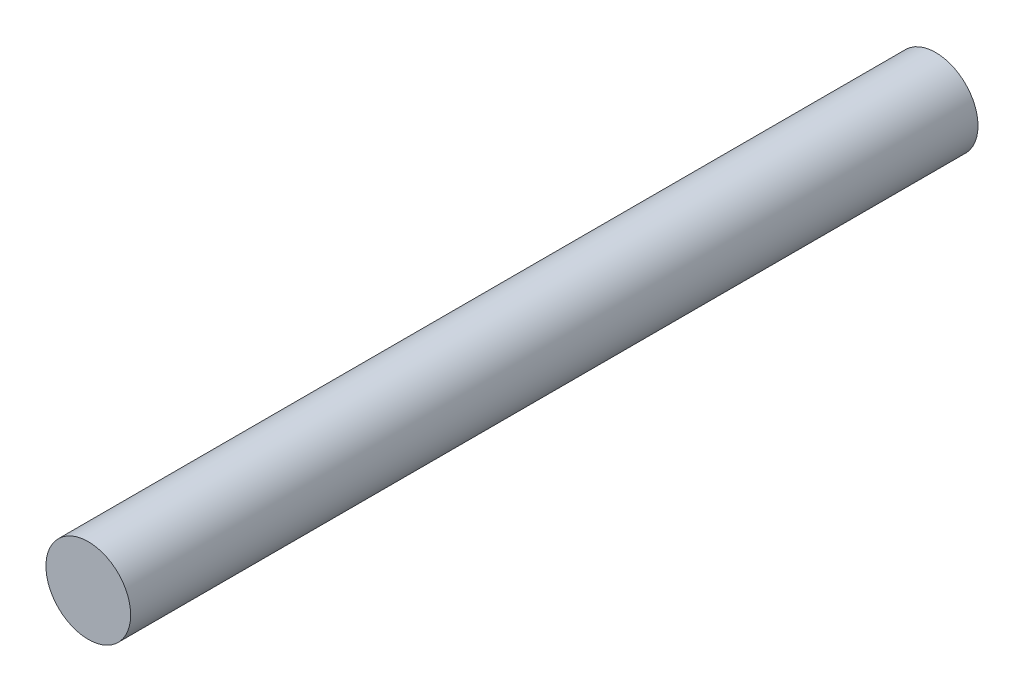
ISO-10303-21;
HEADER;
FILE_DESCRIPTION(('STEP AP214'),'2;1');
FILE_NAME('part.step','',(''),(''),'','','');
FILE_SCHEMA(('AUTOMOTIVE_DESIGN { 1 0 10303 214 1 1 1 1 }'));
ENDSEC;
DATA;
#1=APPLICATION_CONTEXT('core data for automotive mechanical design processes');
#2=APPLICATION_PROTOCOL_DEFINITION('international standard','automotive_design',2000,#1);
#3=PRODUCT_CONTEXT('',#1,'mechanical');
#4=PRODUCT('Part','Part','',(#3));
#5=PRODUCT_RELATED_PRODUCT_CATEGORY('part','',(#4));
#6=PRODUCT_DEFINITION_FORMATION('','',#4);
#7=PRODUCT_DEFINITION_CONTEXT('part definition',#1,'design');
#8=PRODUCT_DEFINITION('design','',#6,#7);
#9=PRODUCT_DEFINITION_SHAPE('','',#8);
#10=(LENGTH_UNIT() NAMED_UNIT(*) SI_UNIT(.MILLI.,.METRE.));
#11=(NAMED_UNIT(*) PLANE_ANGLE_UNIT() SI_UNIT($,.RADIAN.));
#12=(NAMED_UNIT(*) SI_UNIT($,.STERADIAN.) SOLID_ANGLE_UNIT());
#13=UNCERTAINTY_MEASURE_WITH_UNIT(LENGTH_MEASURE(1.E-05),#10,'distance_accuracy_value','');
#14=(GEOMETRIC_REPRESENTATION_CONTEXT(3) GLOBAL_UNCERTAINTY_ASSIGNED_CONTEXT((#13)) GLOBAL_UNIT_ASSIGNED_CONTEXT((#10,
#11,#12)) REPRESENTATION_CONTEXT('',''));
#15=CARTESIAN_POINT('',(0.,0.,0.));
#16=DIRECTION('',(0.,0.,1.));
#17=DIRECTION('',(1.,0.,0.));
#18=AXIS2_PLACEMENT_3D('',#15,#16,#17);
#19=CARTESIAN_POINT('',(0.,0.,2.));
#20=DIRECTION('',(0.,0.,-1.));
#21=DIRECTION('',(-1.,0.,0.));
#22=AXIS2_PLACEMENT_3D('',#19,#20,#21);
#23=CYLINDRICAL_SURFACE('',#22,0.1);
#24=CARTESIAN_POINT('',(0.,0.,2.));
#25=DIRECTION('',(0.,0.,1.));
#26=DIRECTION('',(1.,0.,0.));
#27=AXIS2_PLACEMENT_3D('',#24,#25,#26);
#28=CIRCLE('',#27,0.1);
#29=CARTESIAN_POINT('',(0.1,0.,2.));
#30=VERTEX_POINT('',#29);
#31=EDGE_CURVE('E10',#30,#30,#28,.T.);
#32=ORIENTED_EDGE('',*,*,#31,.F.);
#33=EDGE_LOOP('',(#32));
#34=FACE_BOUND('',#33,.T.);
#35=CARTESIAN_POINT('',(0.,0.,0.));
#36=DIRECTION('',(0.,0.,1.));
#37=DIRECTION('',(1.,0.,0.));
#38=AXIS2_PLACEMENT_3D('',#35,#36,#37);
#39=CIRCLE('',#38,0.1);
#40=CARTESIAN_POINT('',(0.1,0.,0.));
#41=VERTEX_POINT('',#40);
#42=EDGE_CURVE('E35',#41,#41,#39,.T.);
#43=ORIENTED_EDGE('',*,*,#42,.T.);
#44=EDGE_LOOP('',(#43));
#45=FACE_BOUND('',#44,.T.);
#46=ADVANCED_FACE('F32',(#34,#45),#23,.T.);
#47=CARTESIAN_POINT('',(0.,0.,2.));
#48=DIRECTION('',(0.,0.,1.));
#49=DIRECTION('',(1.,0.,0.));
#50=AXIS2_PLACEMENT_3D('',#47,#48,#49);
#51=PLANE('',#50);
#52=ORIENTED_EDGE('',*,*,#31,.T.);
#53=EDGE_LOOP('',(#52));
#54=FACE_BOUND('',#53,.T.);
#55=ADVANCED_FACE('F47',(#54),#51,.T.);
#56=CARTESIAN_POINT('',(0.,0.,0.));
#57=DIRECTION('',(0.,0.,1.));
#58=DIRECTION('',(1.,0.,0.));
#59=AXIS2_PLACEMENT_3D('',#56,#57,#58);
#60=PLANE('',#59);
#61=ORIENTED_EDGE('',*,*,#42,.F.);
#62=EDGE_LOOP('',(#61));
#63=FACE_BOUND('',#62,.T.);
#64=ADVANCED_FACE('F45',(#63),#60,.F.);
#65=CLOSED_SHELL('',(#46,#55,#64));
#66=MANIFOLD_SOLID_BREP('B2',#65);
#67=ADVANCED_BREP_SHAPE_REPRESENTATION('',(#18,#66),#14);
#68=SHAPE_DEFINITION_REPRESENTATION(#9,#67);
ENDSEC;
END-ISO-10303-21;
